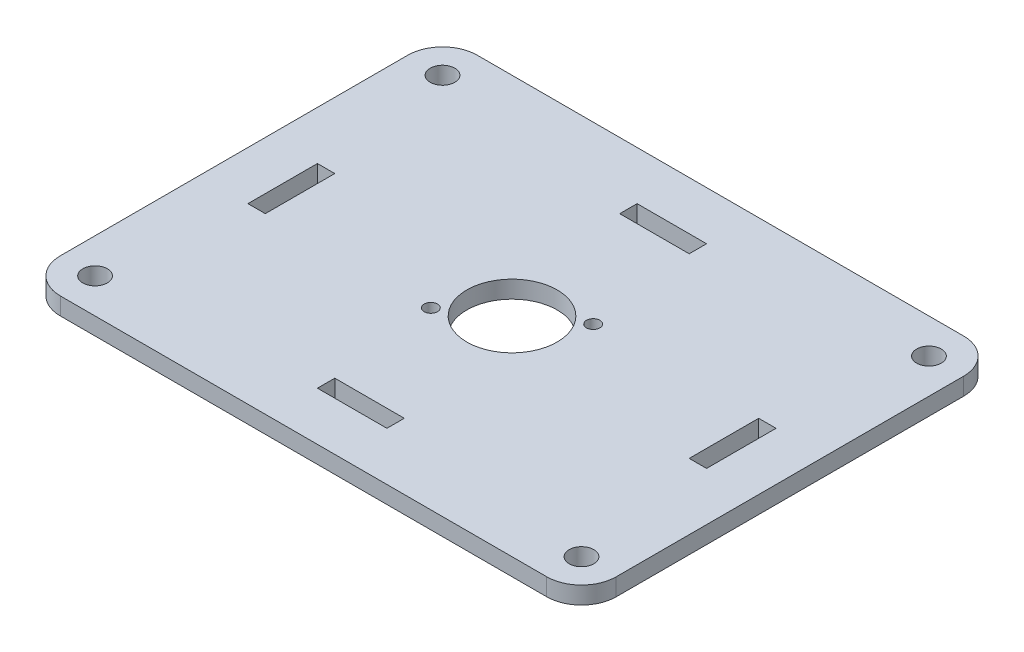
ISO-10303-21;
HEADER;
FILE_DESCRIPTION(('STEP AP214'),'2;1');
FILE_NAME('part.step','',(''),(''),'','','');
FILE_SCHEMA(('AUTOMOTIVE_DESIGN { 1 0 10303 214 1 1 1 1 }'));
ENDSEC;
DATA;
#1=APPLICATION_CONTEXT('core data for automotive mechanical design processes');
#2=APPLICATION_PROTOCOL_DEFINITION('international standard','automotive_design',2000,#1);
#3=PRODUCT_CONTEXT('',#1,'mechanical');
#4=PRODUCT('Part','Part','',(#3));
#5=PRODUCT_RELATED_PRODUCT_CATEGORY('part','',(#4));
#6=PRODUCT_DEFINITION_FORMATION('','',#4);
#7=PRODUCT_DEFINITION_CONTEXT('part definition',#1,'design');
#8=PRODUCT_DEFINITION('design','',#6,#7);
#9=PRODUCT_DEFINITION_SHAPE('','',#8);
#10=(LENGTH_UNIT() NAMED_UNIT(*) SI_UNIT(.MILLI.,.METRE.));
#11=(NAMED_UNIT(*) PLANE_ANGLE_UNIT() SI_UNIT($,.RADIAN.));
#12=(NAMED_UNIT(*) SI_UNIT($,.STERADIAN.) SOLID_ANGLE_UNIT());
#13=UNCERTAINTY_MEASURE_WITH_UNIT(LENGTH_MEASURE(1.E-05),#10,'distance_accuracy_value','');
#14=(GEOMETRIC_REPRESENTATION_CONTEXT(3) GLOBAL_UNCERTAINTY_ASSIGNED_CONTEXT((#13)) GLOBAL_UNIT_ASSIGNED_CONTEXT((#10,
#11,#12)) REPRESENTATION_CONTEXT('',''));
#15=CARTESIAN_POINT('',(0.,0.,0.));
#16=DIRECTION('',(0.,0.,1.));
#17=DIRECTION('',(1.,0.,0.));
#18=AXIS2_PLACEMENT_3D('',#15,#16,#17);
#19=CARTESIAN_POINT('',(50.8,3.175,38.1));
#20=DIRECTION('',(-1.,0.,0.));
#21=DIRECTION('',(0.,0.,1.));
#22=AXIS2_PLACEMENT_3D('',#19,#20,#21);
#23=PLANE('',#22);
#24=DIRECTION('',(0.,0.,-1.));
#25=VECTOR('',#24,1.);
#26=CARTESIAN_POINT('',(50.8,3.175,38.1));
#27=LINE('',#26,#25);
#28=CARTESIAN_POINT('',(50.8,3.175,31.75));
#29=VERTEX_POINT('',#28);
#30=CARTESIAN_POINT('',(50.8,3.175,-31.75));
#31=VERTEX_POINT('',#30);
#32=EDGE_CURVE('E394',#29,#31,#27,.T.);
#33=ORIENTED_EDGE('',*,*,#32,.F.);
#34=DIRECTION('',(0.,-1.,0.));
#35=VECTOR('',#34,1.);
#36=CARTESIAN_POINT('',(50.8,3.175,31.75));
#37=LINE('',#36,#35);
#38=CARTESIAN_POINT('',(50.8,0.,31.75));
#39=VERTEX_POINT('',#38);
#40=EDGE_CURVE('E428',#29,#39,#37,.T.);
#41=ORIENTED_EDGE('',*,*,#40,.T.);
#42=DIRECTION('',(0.,0.,-1.));
#43=VECTOR('',#42,1.);
#44=CARTESIAN_POINT('',(50.8,0.,38.1));
#45=LINE('',#44,#43);
#46=CARTESIAN_POINT('',(50.8,0.,-31.75));
#47=VERTEX_POINT('',#46);
#48=EDGE_CURVE('E385',#39,#47,#45,.T.);
#49=ORIENTED_EDGE('',*,*,#48,.T.);
#50=DIRECTION('',(0.,-1.,0.));
#51=VECTOR('',#50,1.);
#52=CARTESIAN_POINT('',(50.8,3.175,-31.75));
#53=LINE('',#52,#51);
#54=EDGE_CURVE('E411',#47,#31,#53,.F.);
#55=ORIENTED_EDGE('',*,*,#54,.T.);
#56=EDGE_LOOP('',(#33,#41,#49,#55));
#57=FACE_BOUND('',#56,.T.);
#58=ADVANCED_FACE('F38',(#57),#23,.F.);
#59=CARTESIAN_POINT('',(-50.8,3.175,-38.1));
#60=DIRECTION('',(0.,0.,1.));
#61=DIRECTION('',(1.,0.,0.));
#62=AXIS2_PLACEMENT_3D('',#59,#60,#61);
#63=PLANE('',#62);
#64=DIRECTION('',(-1.,0.,0.));
#65=VECTOR('',#64,1.);
#66=CARTESIAN_POINT('',(-50.8,3.175,-38.1));
#67=LINE('',#66,#65);
#68=CARTESIAN_POINT('',(44.45,3.175,-38.1));
#69=VERTEX_POINT('',#68);
#70=CARTESIAN_POINT('',(-44.45,3.175,-38.1));
#71=VERTEX_POINT('',#70);
#72=EDGE_CURVE('E398',#69,#71,#67,.T.);
#73=ORIENTED_EDGE('',*,*,#72,.F.);
#74=DIRECTION('',(0.,-1.,0.));
#75=VECTOR('',#74,1.);
#76=CARTESIAN_POINT('',(44.45,3.175,-38.1));
#77=LINE('',#76,#75);
#78=CARTESIAN_POINT('',(44.45,0.,-38.1));
#79=VERTEX_POINT('',#78);
#80=EDGE_CURVE('E466',#69,#79,#77,.T.);
#81=ORIENTED_EDGE('',*,*,#80,.T.);
#82=DIRECTION('',(-1.,0.,0.));
#83=VECTOR('',#82,1.);
#84=CARTESIAN_POINT('',(-50.8,0.,-38.1));
#85=LINE('',#84,#83);
#86=CARTESIAN_POINT('',(-44.45,0.,-38.1));
#87=VERTEX_POINT('',#86);
#88=EDGE_CURVE('E415',#79,#87,#85,.T.);
#89=ORIENTED_EDGE('',*,*,#88,.T.);
#90=DIRECTION('',(0.,-1.,0.));
#91=VECTOR('',#90,1.);
#92=CARTESIAN_POINT('',(-44.45,3.175,-38.1));
#93=LINE('',#92,#91);
#94=EDGE_CURVE('E463',#87,#71,#93,.F.);
#95=ORIENTED_EDGE('',*,*,#94,.T.);
#96=EDGE_LOOP('',(#73,#81,#89,#95));
#97=FACE_BOUND('',#96,.T.);
#98=ADVANCED_FACE('F503',(#97),#63,.F.);
#99=CARTESIAN_POINT('',(-50.8,3.175,38.1));
#100=DIRECTION('',(1.,0.,0.));
#101=DIRECTION('',(0.,0.,-1.));
#102=AXIS2_PLACEMENT_3D('',#99,#100,#101);
#103=PLANE('',#102);
#104=DIRECTION('',(0.,0.,1.));
#105=VECTOR('',#104,1.);
#106=CARTESIAN_POINT('',(-50.8,3.175,38.1));
#107=LINE('',#106,#105);
#108=CARTESIAN_POINT('',(-50.8,3.175,-31.75));
#109=VERTEX_POINT('',#108);
#110=CARTESIAN_POINT('',(-50.8,3.175,31.75));
#111=VERTEX_POINT('',#110);
#112=EDGE_CURVE('E403',#109,#111,#107,.T.);
#113=ORIENTED_EDGE('',*,*,#112,.F.);
#114=DIRECTION('',(0.,-1.,0.));
#115=VECTOR('',#114,1.);
#116=CARTESIAN_POINT('',(-50.8,3.175,-31.75));
#117=LINE('',#116,#115);
#118=CARTESIAN_POINT('',(-50.8,0.,-31.75));
#119=VERTEX_POINT('',#118);
#120=EDGE_CURVE('E11',#109,#119,#117,.T.);
#121=ORIENTED_EDGE('',*,*,#120,.T.);
#122=DIRECTION('',(0.,0.,1.));
#123=VECTOR('',#122,1.);
#124=CARTESIAN_POINT('',(-50.8,0.,38.1));
#125=LINE('',#124,#123);
#126=CARTESIAN_POINT('',(-50.8,0.,31.75));
#127=VERTEX_POINT('',#126);
#128=EDGE_CURVE('E419',#119,#127,#125,.T.);
#129=ORIENTED_EDGE('',*,*,#128,.T.);
#130=DIRECTION('',(0.,-1.,0.));
#131=VECTOR('',#130,1.);
#132=CARTESIAN_POINT('',(-50.8,3.175,31.75));
#133=LINE('',#132,#131);
#134=EDGE_CURVE('E47',#127,#111,#133,.F.);
#135=ORIENTED_EDGE('',*,*,#134,.T.);
#136=EDGE_LOOP('',(#113,#121,#129,#135));
#137=FACE_BOUND('',#136,.T.);
#138=ADVANCED_FACE('F473',(#137),#103,.F.);
#139=CARTESIAN_POINT('',(-50.8,3.175,38.1));
#140=DIRECTION('',(0.,0.,-1.));
#141=DIRECTION('',(-1.,0.,0.));
#142=AXIS2_PLACEMENT_3D('',#139,#140,#141);
#143=PLANE('',#142);
#144=DIRECTION('',(1.,0.,0.));
#145=VECTOR('',#144,1.);
#146=CARTESIAN_POINT('',(-50.8,0.,38.1));
#147=LINE('',#146,#145);
#148=CARTESIAN_POINT('',(-44.45,0.,38.1));
#149=VERTEX_POINT('',#148);
#150=CARTESIAN_POINT('',(44.45,0.,38.1));
#151=VERTEX_POINT('',#150);
#152=EDGE_CURVE('E399',#149,#151,#147,.T.);
#153=ORIENTED_EDGE('',*,*,#152,.T.);
#154=DIRECTION('',(0.,-1.,0.));
#155=VECTOR('',#154,1.);
#156=CARTESIAN_POINT('',(44.45,3.175,38.1));
#157=LINE('',#156,#155);
#158=CARTESIAN_POINT('',(44.45,3.175,38.1));
#159=VERTEX_POINT('',#158);
#160=EDGE_CURVE('E448',#151,#159,#157,.F.);
#161=ORIENTED_EDGE('',*,*,#160,.T.);
#162=DIRECTION('',(1.,0.,0.));
#163=VECTOR('',#162,1.);
#164=CARTESIAN_POINT('',(-50.8,3.175,38.1));
#165=LINE('',#164,#163);
#166=CARTESIAN_POINT('',(-44.45,3.175,38.1));
#167=VERTEX_POINT('',#166);
#168=EDGE_CURVE('E407',#167,#159,#165,.T.);
#169=ORIENTED_EDGE('',*,*,#168,.F.);
#170=DIRECTION('',(0.,-1.,0.));
#171=VECTOR('',#170,1.);
#172=CARTESIAN_POINT('',(-44.45,3.175,38.1));
#173=LINE('',#172,#171);
#174=EDGE_CURVE('E444',#167,#149,#173,.T.);
#175=ORIENTED_EDGE('',*,*,#174,.T.);
#176=EDGE_LOOP('',(#153,#161,#169,#175));
#177=FACE_BOUND('',#176,.T.);
#178=ADVANCED_FACE('F485',(#177),#143,.F.);
#179=CARTESIAN_POINT('',(0.,3.175,0.));
#180=DIRECTION('',(0.,-1.,0.));
#181=DIRECTION('',(0.,0.,-1.));
#182=AXIS2_PLACEMENT_3D('',#179,#180,#181);
#183=PLANE('',#182);
#184=CARTESIAN_POINT('',(8.6995,3.175,-6.1341));
#185=DIRECTION('',(0.,1.,0.));
#186=DIRECTION('',(0.,0.,1.));
#187=AXIS2_PLACEMENT_3D('',#184,#185,#186);
#188=CIRCLE('',#187,1.2192);
#189=CARTESIAN_POINT('',(8.6995,3.175,-4.9149));
#190=VERTEX_POINT('',#189);
#191=EDGE_CURVE('E817',#190,#190,#188,.T.);
#192=ORIENTED_EDGE('',*,*,#191,.F.);
#193=EDGE_LOOP('',(#192));
#194=FACE_BOUND('',#193,.T.);
#195=CARTESIAN_POINT('',(-8.6995,3.175,6.1341));
#196=DIRECTION('',(0.,1.,0.));
#197=DIRECTION('',(0.,0.,1.));
#198=AXIS2_PLACEMENT_3D('',#195,#196,#197);
#199=CIRCLE('',#198,1.2192);
#200=CARTESIAN_POINT('',(-8.6995,3.175,7.3533));
#201=VERTEX_POINT('',#200);
#202=EDGE_CURVE('E821',#201,#201,#199,.T.);
#203=ORIENTED_EDGE('',*,*,#202,.F.);
#204=EDGE_LOOP('',(#203));
#205=FACE_BOUND('',#204,.T.);
#206=CARTESIAN_POINT('',(0.,3.175,0.));
#207=DIRECTION('',(0.,1.,0.));
#208=DIRECTION('',(0.,0.,1.));
#209=AXIS2_PLACEMENT_3D('',#206,#207,#208);
#210=CIRCLE('',#209,8.255);
#211=CARTESIAN_POINT('',(0.,3.175,8.255));
#212=VERTEX_POINT('',#211);
#213=EDGE_CURVE('E830',#212,#212,#210,.T.);
#214=ORIENTED_EDGE('',*,*,#213,.F.);
#215=EDGE_LOOP('',(#214));
#216=FACE_BOUND('',#215,.T.);
#217=CARTESIAN_POINT('',(-44.45,3.175,-31.75));
#218=DIRECTION('',(0.,1.,0.));
#219=DIRECTION('',(0.,0.,1.));
#220=AXIS2_PLACEMENT_3D('',#217,#218,#219);
#221=CIRCLE('',#220,2.2479);
#222=CARTESIAN_POINT('',(-44.45,3.175,-29.5021));
#223=VERTEX_POINT('',#222);
#224=EDGE_CURVE('E259',#223,#223,#221,.T.);
#225=ORIENTED_EDGE('',*,*,#224,.F.);
#226=EDGE_LOOP('',(#225));
#227=FACE_BOUND('',#226,.T.);
#228=DIRECTION('',(1.,0.,0.));
#229=VECTOR('',#228,1.);
#230=CARTESIAN_POINT('',(0.,3.175,29.21));
#231=LINE('',#230,#229);
#232=CARTESIAN_POINT('',(-6.35,3.175,29.21));
#233=VERTEX_POINT('',#232);
#234=CARTESIAN_POINT('',(6.35,3.175,29.21));
#235=VERTEX_POINT('',#234);
#236=EDGE_CURVE('E236',#233,#235,#231,.T.);
#237=ORIENTED_EDGE('',*,*,#236,.F.);
#238=DIRECTION('',(0.,0.,1.));
#239=VECTOR('',#238,1.);
#240=CARTESIAN_POINT('',(-6.35,3.175,26.035));
#241=LINE('',#240,#239);
#242=CARTESIAN_POINT('',(-6.35,3.175,26.035));
#243=VERTEX_POINT('',#242);
#244=EDGE_CURVE('E54',#243,#233,#241,.T.);
#245=ORIENTED_EDGE('',*,*,#244,.F.);
#246=DIRECTION('',(-1.,0.,0.));
#247=VECTOR('',#246,1.);
#248=CARTESIAN_POINT('',(6.35,3.175,26.035));
#249=LINE('',#248,#247);
#250=CARTESIAN_POINT('',(6.35,3.175,26.035));
#251=VERTEX_POINT('',#250);
#252=EDGE_CURVE('E243',#251,#243,#249,.T.);
#253=ORIENTED_EDGE('',*,*,#252,.F.);
#254=DIRECTION('',(0.,0.,-1.));
#255=VECTOR('',#254,1.);
#256=CARTESIAN_POINT('',(6.35,3.175,29.21));
#257=LINE('',#256,#255);
#258=EDGE_CURVE('E206',#235,#251,#257,.T.);
#259=ORIENTED_EDGE('',*,*,#258,.F.);
#260=EDGE_LOOP('',(#237,#245,#253,#259));
#261=FACE_BOUND('',#260,.T.);
#262=DIRECTION('',(0.,0.,-1.));
#263=VECTOR('',#262,1.);
#264=CARTESIAN_POINT('',(41.91,3.175,0.));
#265=LINE('',#264,#263);
#266=CARTESIAN_POINT('',(41.91,3.175,6.35));
#267=VERTEX_POINT('',#266);
#268=CARTESIAN_POINT('',(41.91,3.175,-6.35));
#269=VERTEX_POINT('',#268);
#270=EDGE_CURVE('E251',#267,#269,#265,.T.);
#271=ORIENTED_EDGE('',*,*,#270,.F.);
#272=DIRECTION('',(1.,0.,0.));
#273=VECTOR('',#272,1.);
#274=CARTESIAN_POINT('',(38.735,3.175,6.35));
#275=LINE('',#274,#273);
#276=CARTESIAN_POINT('',(38.735,3.175,6.35));
#277=VERTEX_POINT('',#276);
#278=EDGE_CURVE('E62',#277,#267,#275,.T.);
#279=ORIENTED_EDGE('',*,*,#278,.F.);
#280=DIRECTION('',(0.,0.,1.));
#281=VECTOR('',#280,1.);
#282=CARTESIAN_POINT('',(38.735,3.175,-6.35));
#283=LINE('',#282,#281);
#284=CARTESIAN_POINT('',(38.735,3.175,-6.35));
#285=VERTEX_POINT('',#284);
#286=EDGE_CURVE('E334',#285,#277,#283,.T.);
#287=ORIENTED_EDGE('',*,*,#286,.F.);
#288=DIRECTION('',(-1.,0.,0.));
#289=VECTOR('',#288,1.);
#290=CARTESIAN_POINT('',(41.91,3.175,-6.35));
#291=LINE('',#290,#289);
#292=EDGE_CURVE('E330',#269,#285,#291,.T.);
#293=ORIENTED_EDGE('',*,*,#292,.F.);
#294=EDGE_LOOP('',(#271,#279,#287,#293));
#295=FACE_BOUND('',#294,.T.);
#296=DIRECTION('',(0.,0.,1.));
#297=VECTOR('',#296,1.);
#298=CARTESIAN_POINT('',(-6.35000000000001,3.175,-26.035));
#299=LINE('',#298,#297);
#300=CARTESIAN_POINT('',(-6.35000000000001,3.175,-29.21));
#301=VERTEX_POINT('',#300);
#302=CARTESIAN_POINT('',(-6.35000000000001,3.175,-26.035));
#303=VERTEX_POINT('',#302);
#304=EDGE_CURVE('E282',#301,#303,#299,.T.);
#305=ORIENTED_EDGE('',*,*,#304,.F.);
#306=DIRECTION('',(-1.,0.,0.));
#307=VECTOR('',#306,1.);
#308=CARTESIAN_POINT('',(0.,3.175,-29.21));
#309=LINE('',#308,#307);
#310=CARTESIAN_POINT('',(6.34999999999999,3.175,-29.21));
#311=VERTEX_POINT('',#310);
#312=EDGE_CURVE('E269',#311,#301,#309,.T.);
#313=ORIENTED_EDGE('',*,*,#312,.F.);
#314=DIRECTION('',(0.,0.,-1.));
#315=VECTOR('',#314,1.);
#316=CARTESIAN_POINT('',(6.34999999999999,3.175,-29.21));
#317=LINE('',#316,#315);
#318=CARTESIAN_POINT('',(6.34999999999999,3.175,-26.035));
#319=VERTEX_POINT('',#318);
#320=EDGE_CURVE('E291',#319,#311,#317,.T.);
#321=ORIENTED_EDGE('',*,*,#320,.F.);
#322=DIRECTION('',(1.,0.,0.));
#323=VECTOR('',#322,1.);
#324=CARTESIAN_POINT('',(6.34999999999999,3.175,-26.035));
#325=LINE('',#324,#323);
#326=EDGE_CURVE('E286',#303,#319,#325,.T.);
#327=ORIENTED_EDGE('',*,*,#326,.F.);
#328=EDGE_LOOP('',(#305,#313,#321,#327));
#329=FACE_BOUND('',#328,.T.);
#330=CARTESIAN_POINT('',(44.45,3.175,-31.75));
#331=DIRECTION('',(0.,1.,0.));
#332=DIRECTION('',(0.,0.,1.));
#333=AXIS2_PLACEMENT_3D('',#330,#331,#332);
#334=CIRCLE('',#333,2.2479);
#335=CARTESIAN_POINT('',(44.45,3.175,-29.5021));
#336=VERTEX_POINT('',#335);
#337=EDGE_CURVE('E838',#336,#336,#334,.T.);
#338=ORIENTED_EDGE('',*,*,#337,.F.);
#339=EDGE_LOOP('',(#338));
#340=FACE_BOUND('',#339,.T.);
#341=CARTESIAN_POINT('',(44.45,3.175,31.75));
#342=DIRECTION('',(0.,1.,0.));
#343=DIRECTION('',(0.,0.,1.));
#344=AXIS2_PLACEMENT_3D('',#341,#342,#343);
#345=CIRCLE('',#344,2.2479);
#346=CARTESIAN_POINT('',(44.45,3.175,33.9979));
#347=VERTEX_POINT('',#346);
#348=EDGE_CURVE('E846',#347,#347,#345,.T.);
#349=ORIENTED_EDGE('',*,*,#348,.F.);
#350=EDGE_LOOP('',(#349));
#351=FACE_BOUND('',#350,.T.);
#352=CARTESIAN_POINT('',(-44.45,3.175,31.75));
#353=DIRECTION('',(0.,1.,0.));
#354=DIRECTION('',(0.,0.,1.));
#355=AXIS2_PLACEMENT_3D('',#352,#353,#354);
#356=CIRCLE('',#355,2.2479);
#357=CARTESIAN_POINT('',(-44.45,3.175,33.9979));
#358=VERTEX_POINT('',#357);
#359=EDGE_CURVE('E829',#358,#358,#356,.T.);
#360=ORIENTED_EDGE('',*,*,#359,.F.);
#361=EDGE_LOOP('',(#360));
#362=FACE_BOUND('',#361,.T.);
#363=DIRECTION('',(1.,0.,0.));
#364=VECTOR('',#363,1.);
#365=CARTESIAN_POINT('',(-38.735,3.175,6.35000000000002));
#366=LINE('',#365,#364);
#367=CARTESIAN_POINT('',(-41.91,3.175,6.35000000000001));
#368=VERTEX_POINT('',#367);
#369=CARTESIAN_POINT('',(-38.735,3.175,6.35000000000002));
#370=VERTEX_POINT('',#369);
#371=EDGE_CURVE('E301',#368,#370,#366,.T.);
#372=ORIENTED_EDGE('',*,*,#371,.F.);
#373=DIRECTION('',(0.,0.,1.));
#374=VECTOR('',#373,1.);
#375=CARTESIAN_POINT('',(-41.91,3.175,0.));
#376=LINE('',#375,#374);
#377=CARTESIAN_POINT('',(-41.91,3.175,-6.34999999999999));
#378=VERTEX_POINT('',#377);
#379=EDGE_CURVE('E355',#378,#368,#376,.T.);
#380=ORIENTED_EDGE('',*,*,#379,.F.);
#381=DIRECTION('',(-1.,0.,0.));
#382=VECTOR('',#381,1.);
#383=CARTESIAN_POINT('',(-41.91,3.175,-6.34999999999999));
#384=LINE('',#383,#382);
#385=CARTESIAN_POINT('',(-38.735,3.175,-6.34999999999999));
#386=VERTEX_POINT('',#385);
#387=EDGE_CURVE('E375',#386,#378,#384,.T.);
#388=ORIENTED_EDGE('',*,*,#387,.F.);
#389=DIRECTION('',(0.,0.,-1.));
#390=VECTOR('',#389,1.);
#391=CARTESIAN_POINT('',(-38.735,3.175,-6.34999999999999));
#392=LINE('',#391,#390);
#393=EDGE_CURVE('E371',#370,#386,#392,.T.);
#394=ORIENTED_EDGE('',*,*,#393,.F.);
#395=EDGE_LOOP('',(#372,#380,#388,#394));
#396=FACE_BOUND('',#395,.T.);
#397=ORIENTED_EDGE('',*,*,#168,.T.);
#398=CARTESIAN_POINT('',(44.45,3.175,31.75));
#399=DIRECTION('',(0.,-1.,0.));
#400=DIRECTION('',(0.,0.,-1.));
#401=AXIS2_PLACEMENT_3D('',#398,#399,#400);
#402=CIRCLE('',#401,6.35);
#403=EDGE_CURVE('E460',#159,#29,#402,.F.);
#404=ORIENTED_EDGE('',*,*,#403,.T.);
#405=ORIENTED_EDGE('',*,*,#32,.T.);
#406=CARTESIAN_POINT('',(44.45,3.175,-31.75));
#407=DIRECTION('',(0.,-1.,0.));
#408=DIRECTION('',(0.,0.,-1.));
#409=AXIS2_PLACEMENT_3D('',#406,#407,#408);
#410=CIRCLE('',#409,6.35);
#411=EDGE_CURVE('E457',#31,#69,#410,.F.);
#412=ORIENTED_EDGE('',*,*,#411,.T.);
#413=ORIENTED_EDGE('',*,*,#72,.T.);
#414=CARTESIAN_POINT('',(-44.45,3.175,-31.75));
#415=DIRECTION('',(0.,-1.,0.));
#416=DIRECTION('',(0.,0.,-1.));
#417=AXIS2_PLACEMENT_3D('',#414,#415,#416);
#418=CIRCLE('',#417,6.35);
#419=EDGE_CURVE('E454',#71,#109,#418,.F.);
#420=ORIENTED_EDGE('',*,*,#419,.T.);
#421=ORIENTED_EDGE('',*,*,#112,.T.);
#422=CARTESIAN_POINT('',(-44.45,3.175,31.75));
#423=DIRECTION('',(0.,-1.,0.));
#424=DIRECTION('',(0.,0.,-1.));
#425=AXIS2_PLACEMENT_3D('',#422,#423,#424);
#426=CIRCLE('',#425,6.35);
#427=EDGE_CURVE('E451',#111,#167,#426,.F.);
#428=ORIENTED_EDGE('',*,*,#427,.T.);
#429=EDGE_LOOP('',(#397,#404,#405,#412,#413,#420,#421,#428));
#430=FACE_BOUND('',#429,.T.);
#431=ADVANCED_FACE('F479',(#194,#205,#216,#227,#261,#295,#329,#340,#351,#362,#396,#430),#183,.F.);
#432=CARTESIAN_POINT('',(0.,0.,0.));
#433=DIRECTION('',(0.,-1.,0.));
#434=DIRECTION('',(0.,0.,-1.));
#435=AXIS2_PLACEMENT_3D('',#432,#433,#434);
#436=PLANE('',#435);
#437=CARTESIAN_POINT('',(8.6995,0.,-6.1341));
#438=DIRECTION('',(0.,1.,0.));
#439=DIRECTION('',(0.,0.,1.));
#440=AXIS2_PLACEMENT_3D('',#437,#438,#439);
#441=CIRCLE('',#440,1.2192);
#442=CARTESIAN_POINT('',(8.6995,0.,-4.9149));
#443=VERTEX_POINT('',#442);
#444=EDGE_CURVE('E814',#443,#443,#441,.T.);
#445=ORIENTED_EDGE('',*,*,#444,.T.);
#446=EDGE_LOOP('',(#445));
#447=FACE_BOUND('',#446,.T.);
#448=CARTESIAN_POINT('',(-8.6995,0.,6.1341));
#449=DIRECTION('',(0.,1.,0.));
#450=DIRECTION('',(0.,0.,1.));
#451=AXIS2_PLACEMENT_3D('',#448,#449,#450);
#452=CIRCLE('',#451,1.2192);
#453=CARTESIAN_POINT('',(-8.6995,0.,7.3533));
#454=VERTEX_POINT('',#453);
#455=EDGE_CURVE('E834',#454,#454,#452,.T.);
#456=ORIENTED_EDGE('',*,*,#455,.T.);
#457=EDGE_LOOP('',(#456));
#458=FACE_BOUND('',#457,.T.);
#459=CARTESIAN_POINT('',(0.,0.,0.));
#460=DIRECTION('',(0.,1.,0.));
#461=DIRECTION('',(0.,0.,1.));
#462=AXIS2_PLACEMENT_3D('',#459,#460,#461);
#463=CIRCLE('',#462,8.255);
#464=CARTESIAN_POINT('',(0.,0.,8.255));
#465=VERTEX_POINT('',#464);
#466=EDGE_CURVE('E825',#465,#465,#463,.T.);
#467=ORIENTED_EDGE('',*,*,#466,.T.);
#468=EDGE_LOOP('',(#467));
#469=FACE_BOUND('',#468,.T.);
#470=CARTESIAN_POINT('',(-44.45,0.,-31.75));
#471=DIRECTION('',(0.,1.,0.));
#472=DIRECTION('',(0.,0.,1.));
#473=AXIS2_PLACEMENT_3D('',#470,#471,#472);
#474=CIRCLE('',#473,2.2479);
#475=CARTESIAN_POINT('',(-44.45,0.,-29.5021));
#476=VERTEX_POINT('',#475);
#477=EDGE_CURVE('E240',#476,#476,#474,.T.);
#478=ORIENTED_EDGE('',*,*,#477,.T.);
#479=EDGE_LOOP('',(#478));
#480=FACE_BOUND('',#479,.T.);
#481=DIRECTION('',(0.,0.,1.));
#482=VECTOR('',#481,1.);
#483=CARTESIAN_POINT('',(-6.35,0.,26.035));
#484=LINE('',#483,#482);
#485=CARTESIAN_POINT('',(-6.35,0.,26.035));
#486=VERTEX_POINT('',#485);
#487=CARTESIAN_POINT('',(-6.35,0.,29.21));
#488=VERTEX_POINT('',#487);
#489=EDGE_CURVE('E221',#486,#488,#484,.T.);
#490=ORIENTED_EDGE('',*,*,#489,.T.);
#491=DIRECTION('',(1.,0.,0.));
#492=VECTOR('',#491,1.);
#493=CARTESIAN_POINT('',(-6.35,0.,29.21));
#494=LINE('',#493,#492);
#495=CARTESIAN_POINT('',(6.35,0.,29.21));
#496=VERTEX_POINT('',#495);
#497=EDGE_CURVE('E227',#488,#496,#494,.T.);
#498=ORIENTED_EDGE('',*,*,#497,.T.);
#499=DIRECTION('',(0.,0.,-1.));
#500=VECTOR('',#499,1.);
#501=CARTESIAN_POINT('',(6.35,0.,29.21));
#502=LINE('',#501,#500);
#503=CARTESIAN_POINT('',(6.35,0.,26.035));
#504=VERTEX_POINT('',#503);
#505=EDGE_CURVE('E203',#496,#504,#502,.T.);
#506=ORIENTED_EDGE('',*,*,#505,.T.);
#507=DIRECTION('',(-1.,0.,0.));
#508=VECTOR('',#507,1.);
#509=CARTESIAN_POINT('',(6.35,0.,26.035));
#510=LINE('',#509,#508);
#511=EDGE_CURVE('E215',#504,#486,#510,.T.);
#512=ORIENTED_EDGE('',*,*,#511,.T.);
#513=EDGE_LOOP('',(#490,#498,#506,#512));
#514=FACE_BOUND('',#513,.T.);
#515=DIRECTION('',(1.,0.,0.));
#516=VECTOR('',#515,1.);
#517=CARTESIAN_POINT('',(38.735,0.,6.35));
#518=LINE('',#517,#516);
#519=CARTESIAN_POINT('',(38.735,0.,6.35));
#520=VERTEX_POINT('',#519);
#521=CARTESIAN_POINT('',(41.91,0.,6.35));
#522=VERTEX_POINT('',#521);
#523=EDGE_CURVE('E322',#520,#522,#518,.T.);
#524=ORIENTED_EDGE('',*,*,#523,.T.);
#525=DIRECTION('',(0.,0.,-1.));
#526=VECTOR('',#525,1.);
#527=CARTESIAN_POINT('',(41.91,0.,6.35));
#528=LINE('',#527,#526);
#529=CARTESIAN_POINT('',(41.91,0.,-6.35));
#530=VERTEX_POINT('',#529);
#531=EDGE_CURVE('E310',#522,#530,#528,.T.);
#532=ORIENTED_EDGE('',*,*,#531,.T.);
#533=DIRECTION('',(-1.,0.,0.));
#534=VECTOR('',#533,1.);
#535=CARTESIAN_POINT('',(41.91,0.,-6.35));
#536=LINE('',#535,#534);
#537=CARTESIAN_POINT('',(38.735,0.,-6.35));
#538=VERTEX_POINT('',#537);
#539=EDGE_CURVE('E314',#530,#538,#536,.T.);
#540=ORIENTED_EDGE('',*,*,#539,.T.);
#541=DIRECTION('',(0.,0.,1.));
#542=VECTOR('',#541,1.);
#543=CARTESIAN_POINT('',(38.735,0.,-6.35));
#544=LINE('',#543,#542);
#545=EDGE_CURVE('E318',#538,#520,#544,.T.);
#546=ORIENTED_EDGE('',*,*,#545,.T.);
#547=EDGE_LOOP('',(#524,#532,#540,#546));
#548=FACE_BOUND('',#547,.T.);
#549=DIRECTION('',(-1.,0.,0.));
#550=VECTOR('',#549,1.);
#551=CARTESIAN_POINT('',(-6.35000000000001,0.,-29.21));
#552=LINE('',#551,#550);
#553=CARTESIAN_POINT('',(6.34999999999999,0.,-29.21));
#554=VERTEX_POINT('',#553);
#555=CARTESIAN_POINT('',(-6.35000000000001,0.,-29.21));
#556=VERTEX_POINT('',#555);
#557=EDGE_CURVE('E264',#554,#556,#552,.T.);
#558=ORIENTED_EDGE('',*,*,#557,.T.);
#559=DIRECTION('',(0.,0.,1.));
#560=VECTOR('',#559,1.);
#561=CARTESIAN_POINT('',(-6.35000000000001,0.,-26.035));
#562=LINE('',#561,#560);
#563=CARTESIAN_POINT('',(-6.35000000000001,0.,-26.035));
#564=VERTEX_POINT('',#563);
#565=EDGE_CURVE('E268',#556,#564,#562,.T.);
#566=ORIENTED_EDGE('',*,*,#565,.T.);
#567=DIRECTION('',(1.,0.,0.));
#568=VECTOR('',#567,1.);
#569=CARTESIAN_POINT('',(6.34999999999999,0.,-26.035));
#570=LINE('',#569,#568);
#571=CARTESIAN_POINT('',(6.34999999999999,0.,-26.035));
#572=VERTEX_POINT('',#571);
#573=EDGE_CURVE('E273',#564,#572,#570,.T.);
#574=ORIENTED_EDGE('',*,*,#573,.T.);
#575=DIRECTION('',(0.,0.,-1.));
#576=VECTOR('',#575,1.);
#577=CARTESIAN_POINT('',(6.34999999999999,0.,-29.21));
#578=LINE('',#577,#576);
#579=EDGE_CURVE('E277',#572,#554,#578,.T.);
#580=ORIENTED_EDGE('',*,*,#579,.T.);
#581=EDGE_LOOP('',(#558,#566,#574,#580));
#582=FACE_BOUND('',#581,.T.);
#583=CARTESIAN_POINT('',(44.45,0.,-31.75));
#584=DIRECTION('',(0.,1.,0.));
#585=DIRECTION('',(0.,0.,1.));
#586=AXIS2_PLACEMENT_3D('',#583,#584,#585);
#587=CIRCLE('',#586,2.2479);
#588=CARTESIAN_POINT('',(44.45,0.,-29.5021));
#589=VERTEX_POINT('',#588);
#590=EDGE_CURVE('E263',#589,#589,#587,.T.);
#591=ORIENTED_EDGE('',*,*,#590,.T.);
#592=EDGE_LOOP('',(#591));
#593=FACE_BOUND('',#592,.T.);
#594=CARTESIAN_POINT('',(44.45,0.,31.75));
#595=DIRECTION('',(0.,1.,0.));
#596=DIRECTION('',(0.,0.,1.));
#597=AXIS2_PLACEMENT_3D('',#594,#595,#596);
#598=CIRCLE('',#597,2.2479);
#599=CARTESIAN_POINT('',(44.45,0.,33.9979));
#600=VERTEX_POINT('',#599);
#601=EDGE_CURVE('E842',#600,#600,#598,.T.);
#602=ORIENTED_EDGE('',*,*,#601,.T.);
#603=EDGE_LOOP('',(#602));
#604=FACE_BOUND('',#603,.T.);
#605=CARTESIAN_POINT('',(-44.45,0.,31.75));
#606=DIRECTION('',(0.,1.,0.));
#607=DIRECTION('',(0.,0.,1.));
#608=AXIS2_PLACEMENT_3D('',#605,#606,#607);
#609=CIRCLE('',#608,2.2479);
#610=CARTESIAN_POINT('',(-44.45,0.,33.9979));
#611=VERTEX_POINT('',#610);
#612=EDGE_CURVE('E850',#611,#611,#609,.T.);
#613=ORIENTED_EDGE('',*,*,#612,.T.);
#614=EDGE_LOOP('',(#613));
#615=FACE_BOUND('',#614,.T.);
#616=DIRECTION('',(0.,0.,1.));
#617=VECTOR('',#616,1.);
#618=CARTESIAN_POINT('',(-41.91,0.,6.35000000000001));
#619=LINE('',#618,#617);
#620=CARTESIAN_POINT('',(-41.91,0.,-6.34999999999999));
#621=VERTEX_POINT('',#620);
#622=CARTESIAN_POINT('',(-41.91,0.,6.35000000000001));
#623=VERTEX_POINT('',#622);
#624=EDGE_CURVE('E350',#621,#623,#619,.T.);
#625=ORIENTED_EDGE('',*,*,#624,.T.);
#626=DIRECTION('',(1.,0.,0.));
#627=VECTOR('',#626,1.);
#628=CARTESIAN_POINT('',(-38.735,0.,6.35000000000002));
#629=LINE('',#628,#627);
#630=CARTESIAN_POINT('',(-38.735,0.,6.35000000000002));
#631=VERTEX_POINT('',#630);
#632=EDGE_CURVE('E354',#623,#631,#629,.T.);
#633=ORIENTED_EDGE('',*,*,#632,.T.);
#634=DIRECTION('',(0.,0.,-1.));
#635=VECTOR('',#634,1.);
#636=CARTESIAN_POINT('',(-38.735,0.,-6.34999999999999));
#637=LINE('',#636,#635);
#638=CARTESIAN_POINT('',(-38.735,0.,-6.34999999999999));
#639=VERTEX_POINT('',#638);
#640=EDGE_CURVE('E359',#631,#639,#637,.T.);
#641=ORIENTED_EDGE('',*,*,#640,.T.);
#642=DIRECTION('',(-1.,0.,0.));
#643=VECTOR('',#642,1.);
#644=CARTESIAN_POINT('',(-41.91,0.,-6.34999999999999));
#645=LINE('',#644,#643);
#646=EDGE_CURVE('E363',#639,#621,#645,.T.);
#647=ORIENTED_EDGE('',*,*,#646,.T.);
#648=EDGE_LOOP('',(#625,#633,#641,#647));
#649=FACE_BOUND('',#648,.T.);
#650=ORIENTED_EDGE('',*,*,#48,.F.);
#651=CARTESIAN_POINT('',(44.45,0.,31.75));
#652=DIRECTION('',(0.,-1.,0.));
#653=DIRECTION('',(0.,0.,-1.));
#654=AXIS2_PLACEMENT_3D('',#651,#652,#653);
#655=CIRCLE('',#654,6.35);
#656=EDGE_CURVE('E441',#39,#151,#655,.T.);
#657=ORIENTED_EDGE('',*,*,#656,.T.);
#658=ORIENTED_EDGE('',*,*,#152,.F.);
#659=CARTESIAN_POINT('',(-44.45,0.,31.75));
#660=DIRECTION('',(0.,-1.,0.));
#661=DIRECTION('',(0.,0.,-1.));
#662=AXIS2_PLACEMENT_3D('',#659,#660,#661);
#663=CIRCLE('',#662,6.35);
#664=EDGE_CURVE('E432',#149,#127,#663,.T.);
#665=ORIENTED_EDGE('',*,*,#664,.T.);
#666=ORIENTED_EDGE('',*,*,#128,.F.);
#667=CARTESIAN_POINT('',(-44.45,0.,-31.75));
#668=DIRECTION('',(0.,-1.,0.));
#669=DIRECTION('',(0.,0.,-1.));
#670=AXIS2_PLACEMENT_3D('',#667,#668,#669);
#671=CIRCLE('',#670,6.35);
#672=EDGE_CURVE('E435',#119,#87,#671,.T.);
#673=ORIENTED_EDGE('',*,*,#672,.T.);
#674=ORIENTED_EDGE('',*,*,#88,.F.);
#675=CARTESIAN_POINT('',(44.45,0.,-31.75));
#676=DIRECTION('',(0.,-1.,0.));
#677=DIRECTION('',(0.,0.,-1.));
#678=AXIS2_PLACEMENT_3D('',#675,#676,#677);
#679=CIRCLE('',#678,6.35);
#680=EDGE_CURVE('E438',#79,#47,#679,.T.);
#681=ORIENTED_EDGE('',*,*,#680,.T.);
#682=EDGE_LOOP('',(#650,#657,#658,#665,#666,#673,#674,#681));
#683=FACE_BOUND('',#682,.T.);
#684=ADVANCED_FACE('F224',(#447,#458,#469,#480,#514,#548,#582,#593,#604,#615,#649,#683),#436,.T.);
#685=CARTESIAN_POINT('',(44.45,3.175,31.75));
#686=DIRECTION('',(0.,-1.,0.));
#687=DIRECTION('',(0.,0.,-1.));
#688=AXIS2_PLACEMENT_3D('',#685,#686,#687);
#689=CYLINDRICAL_SURFACE('',#688,6.35);
#690=ORIENTED_EDGE('',*,*,#403,.F.);
#691=ORIENTED_EDGE('',*,*,#160,.F.);
#692=ORIENTED_EDGE('',*,*,#656,.F.);
#693=ORIENTED_EDGE('',*,*,#40,.F.);
#694=EDGE_LOOP('',(#690,#691,#692,#693));
#695=FACE_BOUND('',#694,.T.);
#696=ADVANCED_FACE('F492',(#695),#689,.T.);
#697=CARTESIAN_POINT('',(44.45,3.175,-31.75));
#698=DIRECTION('',(0.,-1.,0.));
#699=DIRECTION('',(0.,0.,-1.));
#700=AXIS2_PLACEMENT_3D('',#697,#698,#699);
#701=CYLINDRICAL_SURFACE('',#700,6.35);
#702=ORIENTED_EDGE('',*,*,#411,.F.);
#703=ORIENTED_EDGE('',*,*,#54,.F.);
#704=ORIENTED_EDGE('',*,*,#680,.F.);
#705=ORIENTED_EDGE('',*,*,#80,.F.);
#706=EDGE_LOOP('',(#702,#703,#704,#705));
#707=FACE_BOUND('',#706,.T.);
#708=ADVANCED_FACE('F500',(#707),#701,.T.);
#709=CARTESIAN_POINT('',(-44.45,3.175,-31.75));
#710=DIRECTION('',(0.,-1.,0.));
#711=DIRECTION('',(0.,0.,-1.));
#712=AXIS2_PLACEMENT_3D('',#709,#710,#711);
#713=CYLINDRICAL_SURFACE('',#712,6.35);
#714=ORIENTED_EDGE('',*,*,#419,.F.);
#715=ORIENTED_EDGE('',*,*,#94,.F.);
#716=ORIENTED_EDGE('',*,*,#672,.F.);
#717=ORIENTED_EDGE('',*,*,#120,.F.);
#718=EDGE_LOOP('',(#714,#715,#716,#717));
#719=FACE_BOUND('',#718,.T.);
#720=ADVANCED_FACE('F506',(#719),#713,.T.);
#721=CARTESIAN_POINT('',(-44.45,3.175,31.75));
#722=DIRECTION('',(0.,-1.,0.));
#723=DIRECTION('',(0.,0.,-1.));
#724=AXIS2_PLACEMENT_3D('',#721,#722,#723);
#725=CYLINDRICAL_SURFACE('',#724,6.35);
#726=ORIENTED_EDGE('',*,*,#427,.F.);
#727=ORIENTED_EDGE('',*,*,#134,.F.);
#728=ORIENTED_EDGE('',*,*,#664,.F.);
#729=ORIENTED_EDGE('',*,*,#174,.F.);
#730=EDGE_LOOP('',(#726,#727,#728,#729));
#731=FACE_BOUND('',#730,.T.);
#732=ADVANCED_FACE('F40',(#731),#725,.T.);
#733=CARTESIAN_POINT('',(-41.91,0.,0.));
#734=DIRECTION('',(-1.,0.,0.));
#735=DIRECTION('',(0.,0.,1.));
#736=AXIS2_PLACEMENT_3D('',#733,#734,#735);
#737=PLANE('',#736);
#738=ORIENTED_EDGE('',*,*,#379,.T.);
#739=DIRECTION('',(0.,1.,0.));
#740=VECTOR('',#739,1.);
#741=CARTESIAN_POINT('',(-41.91,0.,6.35000000000001));
#742=LINE('',#741,#740);
#743=EDGE_CURVE('E367',#623,#368,#742,.T.);
#744=ORIENTED_EDGE('',*,*,#743,.F.);
#745=ORIENTED_EDGE('',*,*,#624,.F.);
#746=DIRECTION('',(0.,1.,0.));
#747=VECTOR('',#746,1.);
#748=CARTESIAN_POINT('',(-41.91,0.,-6.34999999999999));
#749=LINE('',#748,#747);
#750=EDGE_CURVE('E382',#621,#378,#749,.T.);
#751=ORIENTED_EDGE('',*,*,#750,.T.);
#752=EDGE_LOOP('',(#738,#744,#745,#751));
#753=FACE_BOUND('',#752,.T.);
#754=ADVANCED_FACE('F512',(#753),#737,.F.);
#755=CARTESIAN_POINT('',(-41.91,0.,-6.34999999999999));
#756=DIRECTION('',(0.,0.,-1.));
#757=DIRECTION('',(-1.,0.,0.));
#758=AXIS2_PLACEMENT_3D('',#755,#756,#757);
#759=PLANE('',#758);
#760=ORIENTED_EDGE('',*,*,#387,.T.);
#761=ORIENTED_EDGE('',*,*,#750,.F.);
#762=ORIENTED_EDGE('',*,*,#646,.F.);
#763=DIRECTION('',(0.,1.,0.));
#764=VECTOR('',#763,1.);
#765=CARTESIAN_POINT('',(-38.735,0.,-6.34999999999999));
#766=LINE('',#765,#764);
#767=EDGE_CURVE('E386',#639,#386,#766,.T.);
#768=ORIENTED_EDGE('',*,*,#767,.T.);
#769=EDGE_LOOP('',(#760,#761,#762,#768));
#770=FACE_BOUND('',#769,.T.);
#771=ADVANCED_FACE('F585',(#770),#759,.F.);
#772=CARTESIAN_POINT('',(-38.735,0.,-6.34999999999999));
#773=DIRECTION('',(1.,0.,0.));
#774=DIRECTION('',(0.,0.,-1.));
#775=AXIS2_PLACEMENT_3D('',#772,#773,#774);
#776=PLANE('',#775);
#777=ORIENTED_EDGE('',*,*,#393,.T.);
#778=ORIENTED_EDGE('',*,*,#767,.F.);
#779=ORIENTED_EDGE('',*,*,#640,.F.);
#780=DIRECTION('',(0.,1.,0.));
#781=VECTOR('',#780,1.);
#782=CARTESIAN_POINT('',(-38.735,0.,6.35000000000002));
#783=LINE('',#782,#781);
#784=EDGE_CURVE('E389',#631,#370,#783,.T.);
#785=ORIENTED_EDGE('',*,*,#784,.T.);
#786=EDGE_LOOP('',(#777,#778,#779,#785));
#787=FACE_BOUND('',#786,.T.);
#788=ADVANCED_FACE('F597',(#787),#776,.F.);
#789=CARTESIAN_POINT('',(-38.735,0.,6.35000000000002));
#790=DIRECTION('',(0.,0.,1.));
#791=DIRECTION('',(1.,0.,0.));
#792=AXIS2_PLACEMENT_3D('',#789,#790,#791);
#793=PLANE('',#792);
#794=ORIENTED_EDGE('',*,*,#371,.T.);
#795=ORIENTED_EDGE('',*,*,#784,.F.);
#796=ORIENTED_EDGE('',*,*,#632,.F.);
#797=ORIENTED_EDGE('',*,*,#743,.T.);
#798=EDGE_LOOP('',(#794,#795,#796,#797));
#799=FACE_BOUND('',#798,.T.);
#800=ADVANCED_FACE('F606',(#799),#793,.F.);
#801=CARTESIAN_POINT('',(-44.45,0.,31.75));
#802=DIRECTION('',(0.,1.,0.));
#803=DIRECTION('',(0.,0.,1.));
#804=AXIS2_PLACEMENT_3D('',#801,#802,#803);
#805=CYLINDRICAL_SURFACE('',#804,2.2479);
#806=ORIENTED_EDGE('',*,*,#612,.F.);
#807=EDGE_LOOP('',(#806));
#808=FACE_BOUND('',#807,.T.);
#809=ORIENTED_EDGE('',*,*,#359,.T.);
#810=EDGE_LOOP('',(#809));
#811=FACE_BOUND('',#810,.T.);
#812=ADVANCED_FACE('F615',(#808,#811),#805,.F.);
#813=CARTESIAN_POINT('',(44.45,0.,31.75));
#814=DIRECTION('',(0.,1.,0.));
#815=DIRECTION('',(0.,0.,1.));
#816=AXIS2_PLACEMENT_3D('',#813,#814,#815);
#817=CYLINDRICAL_SURFACE('',#816,2.2479);
#818=ORIENTED_EDGE('',*,*,#601,.F.);
#819=EDGE_LOOP('',(#818));
#820=FACE_BOUND('',#819,.T.);
#821=ORIENTED_EDGE('',*,*,#348,.T.);
#822=EDGE_LOOP('',(#821));
#823=FACE_BOUND('',#822,.T.);
#824=ADVANCED_FACE('F623',(#820,#823),#817,.F.);
#825=CARTESIAN_POINT('',(44.45,0.,-31.75));
#826=DIRECTION('',(0.,1.,0.));
#827=DIRECTION('',(0.,0.,1.));
#828=AXIS2_PLACEMENT_3D('',#825,#826,#827);
#829=CYLINDRICAL_SURFACE('',#828,2.2479);
#830=ORIENTED_EDGE('',*,*,#590,.F.);
#831=EDGE_LOOP('',(#830));
#832=FACE_BOUND('',#831,.T.);
#833=ORIENTED_EDGE('',*,*,#337,.T.);
#834=EDGE_LOOP('',(#833));
#835=FACE_BOUND('',#834,.T.);
#836=ADVANCED_FACE('F632',(#832,#835),#829,.F.);
#837=CARTESIAN_POINT('',(0.,0.,-29.21));
#838=DIRECTION('',(0.,0.,-1.));
#839=DIRECTION('',(-1.,0.,0.));
#840=AXIS2_PLACEMENT_3D('',#837,#838,#839);
#841=PLANE('',#840);
#842=ORIENTED_EDGE('',*,*,#312,.T.);
#843=DIRECTION('',(0.,1.,0.));
#844=VECTOR('',#843,1.);
#845=CARTESIAN_POINT('',(-6.35000000000001,0.,-29.21));
#846=LINE('',#845,#844);
#847=EDGE_CURVE('E281',#556,#301,#846,.T.);
#848=ORIENTED_EDGE('',*,*,#847,.F.);
#849=ORIENTED_EDGE('',*,*,#557,.F.);
#850=DIRECTION('',(0.,1.,0.));
#851=VECTOR('',#850,1.);
#852=CARTESIAN_POINT('',(6.34999999999999,0.,-29.21));
#853=LINE('',#852,#851);
#854=EDGE_CURVE('E298',#554,#311,#853,.T.);
#855=ORIENTED_EDGE('',*,*,#854,.T.);
#856=EDGE_LOOP('',(#842,#848,#849,#855));
#857=FACE_BOUND('',#856,.T.);
#858=ADVANCED_FACE('F641',(#857),#841,.F.);
#859=CARTESIAN_POINT('',(6.34999999999999,0.,-29.21));
#860=DIRECTION('',(1.,0.,0.));
#861=DIRECTION('',(0.,0.,-1.));
#862=AXIS2_PLACEMENT_3D('',#859,#860,#861);
#863=PLANE('',#862);
#864=ORIENTED_EDGE('',*,*,#320,.T.);
#865=ORIENTED_EDGE('',*,*,#854,.F.);
#866=ORIENTED_EDGE('',*,*,#579,.F.);
#867=DIRECTION('',(0.,1.,0.));
#868=VECTOR('',#867,1.);
#869=CARTESIAN_POINT('',(6.34999999999999,0.,-26.035));
#870=LINE('',#869,#868);
#871=EDGE_CURVE('E302',#572,#319,#870,.T.);
#872=ORIENTED_EDGE('',*,*,#871,.T.);
#873=EDGE_LOOP('',(#864,#865,#866,#872));
#874=FACE_BOUND('',#873,.T.);
#875=ADVANCED_FACE('F650',(#874),#863,.F.);
#876=CARTESIAN_POINT('',(6.34999999999999,0.,-26.035));
#877=DIRECTION('',(0.,0.,1.));
#878=DIRECTION('',(1.,0.,0.));
#879=AXIS2_PLACEMENT_3D('',#876,#877,#878);
#880=PLANE('',#879);
#881=ORIENTED_EDGE('',*,*,#326,.T.);
#882=ORIENTED_EDGE('',*,*,#871,.F.);
#883=ORIENTED_EDGE('',*,*,#573,.F.);
#884=DIRECTION('',(0.,1.,0.));
#885=VECTOR('',#884,1.);
#886=CARTESIAN_POINT('',(-6.35000000000001,0.,-26.035));
#887=LINE('',#886,#885);
#888=EDGE_CURVE('E305',#564,#303,#887,.T.);
#889=ORIENTED_EDGE('',*,*,#888,.T.);
#890=EDGE_LOOP('',(#881,#882,#883,#889));
#891=FACE_BOUND('',#890,.T.);
#892=ADVANCED_FACE('F662',(#891),#880,.F.);
#893=CARTESIAN_POINT('',(-6.35000000000001,0.,-26.035));
#894=DIRECTION('',(-1.,0.,0.));
#895=DIRECTION('',(0.,0.,1.));
#896=AXIS2_PLACEMENT_3D('',#893,#894,#895);
#897=PLANE('',#896);
#898=ORIENTED_EDGE('',*,*,#304,.T.);
#899=ORIENTED_EDGE('',*,*,#888,.F.);
#900=ORIENTED_EDGE('',*,*,#565,.F.);
#901=ORIENTED_EDGE('',*,*,#847,.T.);
#902=EDGE_LOOP('',(#898,#899,#900,#901));
#903=FACE_BOUND('',#902,.T.);
#904=ADVANCED_FACE('F671',(#903),#897,.F.);
#905=CARTESIAN_POINT('',(38.735,0.,6.35));
#906=DIRECTION('',(0.,0.,1.));
#907=DIRECTION('',(1.,0.,0.));
#908=AXIS2_PLACEMENT_3D('',#905,#906,#907);
#909=PLANE('',#908);
#910=ORIENTED_EDGE('',*,*,#278,.T.);
#911=DIRECTION('',(0.,1.,0.));
#912=VECTOR('',#911,1.);
#913=CARTESIAN_POINT('',(41.91,0.,6.35));
#914=LINE('',#913,#912);
#915=EDGE_CURVE('E287',#522,#267,#914,.T.);
#916=ORIENTED_EDGE('',*,*,#915,.F.);
#917=ORIENTED_EDGE('',*,*,#523,.F.);
#918=DIRECTION('',(0.,1.,0.));
#919=VECTOR('',#918,1.);
#920=CARTESIAN_POINT('',(38.735,0.,6.35));
#921=LINE('',#920,#919);
#922=EDGE_CURVE('E342',#520,#277,#921,.T.);
#923=ORIENTED_EDGE('',*,*,#922,.T.);
#924=EDGE_LOOP('',(#910,#916,#917,#923));
#925=FACE_BOUND('',#924,.T.);
#926=ADVANCED_FACE('F680',(#925),#909,.F.);
#927=CARTESIAN_POINT('',(38.735,0.,-6.35));
#928=DIRECTION('',(-1.,0.,0.));
#929=DIRECTION('',(0.,0.,1.));
#930=AXIS2_PLACEMENT_3D('',#927,#928,#929);
#931=PLANE('',#930);
#932=ORIENTED_EDGE('',*,*,#286,.T.);
#933=ORIENTED_EDGE('',*,*,#922,.F.);
#934=ORIENTED_EDGE('',*,*,#545,.F.);
#935=DIRECTION('',(0.,1.,0.));
#936=VECTOR('',#935,1.);
#937=CARTESIAN_POINT('',(38.735,0.,-6.35));
#938=LINE('',#937,#936);
#939=EDGE_CURVE('E345',#538,#285,#938,.T.);
#940=ORIENTED_EDGE('',*,*,#939,.T.);
#941=EDGE_LOOP('',(#932,#933,#934,#940));
#942=FACE_BOUND('',#941,.T.);
#943=ADVANCED_FACE('F689',(#942),#931,.F.);
#944=CARTESIAN_POINT('',(41.91,0.,-6.35));
#945=DIRECTION('',(0.,0.,-1.));
#946=DIRECTION('',(-1.,0.,0.));
#947=AXIS2_PLACEMENT_3D('',#944,#945,#946);
#948=PLANE('',#947);
#949=ORIENTED_EDGE('',*,*,#292,.T.);
#950=ORIENTED_EDGE('',*,*,#939,.F.);
#951=ORIENTED_EDGE('',*,*,#539,.F.);
#952=DIRECTION('',(0.,1.,0.));
#953=VECTOR('',#952,1.);
#954=CARTESIAN_POINT('',(41.91,0.,-6.35));
#955=LINE('',#954,#953);
#956=EDGE_CURVE('E326',#530,#269,#955,.T.);
#957=ORIENTED_EDGE('',*,*,#956,.T.);
#958=EDGE_LOOP('',(#949,#950,#951,#957));
#959=FACE_BOUND('',#958,.T.);
#960=ADVANCED_FACE('F697',(#959),#948,.F.);
#961=CARTESIAN_POINT('',(41.91,0.,0.));
#962=DIRECTION('',(1.,0.,0.));
#963=DIRECTION('',(0.,0.,-1.));
#964=AXIS2_PLACEMENT_3D('',#961,#962,#963);
#965=PLANE('',#964);
#966=ORIENTED_EDGE('',*,*,#270,.T.);
#967=ORIENTED_EDGE('',*,*,#956,.F.);
#968=ORIENTED_EDGE('',*,*,#531,.F.);
#969=ORIENTED_EDGE('',*,*,#915,.T.);
#970=EDGE_LOOP('',(#966,#967,#968,#969));
#971=FACE_BOUND('',#970,.T.);
#972=ADVANCED_FACE('F706',(#971),#965,.F.);
#973=CARTESIAN_POINT('',(-6.35,0.,26.035));
#974=DIRECTION('',(-1.,0.,0.));
#975=DIRECTION('',(0.,0.,1.));
#976=AXIS2_PLACEMENT_3D('',#973,#974,#975);
#977=PLANE('',#976);
#978=ORIENTED_EDGE('',*,*,#244,.T.);
#979=DIRECTION('',(0.,1.,0.));
#980=VECTOR('',#979,1.);
#981=CARTESIAN_POINT('',(-6.35,0.,29.21));
#982=LINE('',#981,#980);
#983=EDGE_CURVE('E248',#488,#233,#982,.T.);
#984=ORIENTED_EDGE('',*,*,#983,.F.);
#985=ORIENTED_EDGE('',*,*,#489,.F.);
#986=DIRECTION('',(0.,1.,0.));
#987=VECTOR('',#986,1.);
#988=CARTESIAN_POINT('',(-6.35,0.,26.035));
#989=LINE('',#988,#987);
#990=EDGE_CURVE('E211',#486,#243,#989,.T.);
#991=ORIENTED_EDGE('',*,*,#990,.T.);
#992=EDGE_LOOP('',(#978,#984,#985,#991));
#993=FACE_BOUND('',#992,.T.);
#994=ADVANCED_FACE('F715',(#993),#977,.F.);
#995=CARTESIAN_POINT('',(6.35,0.,26.035));
#996=DIRECTION('',(0.,0.,-1.));
#997=DIRECTION('',(-1.,0.,0.));
#998=AXIS2_PLACEMENT_3D('',#995,#996,#997);
#999=PLANE('',#998);
#1000=ORIENTED_EDGE('',*,*,#252,.T.);
#1001=ORIENTED_EDGE('',*,*,#990,.F.);
#1002=ORIENTED_EDGE('',*,*,#511,.F.);
#1003=DIRECTION('',(0.,1.,0.));
#1004=VECTOR('',#1003,1.);
#1005=CARTESIAN_POINT('',(6.35,0.,26.035));
#1006=LINE('',#1005,#1004);
#1007=EDGE_CURVE('E199',#504,#251,#1006,.T.);
#1008=ORIENTED_EDGE('',*,*,#1007,.T.);
#1009=EDGE_LOOP('',(#1000,#1001,#1002,#1008));
#1010=FACE_BOUND('',#1009,.T.);
#1011=ADVANCED_FACE('F216',(#1010),#999,.F.);
#1012=CARTESIAN_POINT('',(6.35,0.,29.21));
#1013=DIRECTION('',(1.,0.,0.));
#1014=DIRECTION('',(0.,0.,-1.));
#1015=AXIS2_PLACEMENT_3D('',#1012,#1013,#1014);
#1016=PLANE('',#1015);
#1017=ORIENTED_EDGE('',*,*,#258,.T.);
#1018=ORIENTED_EDGE('',*,*,#1007,.F.);
#1019=ORIENTED_EDGE('',*,*,#505,.F.);
#1020=DIRECTION('',(0.,1.,0.));
#1021=VECTOR('',#1020,1.);
#1022=CARTESIAN_POINT('',(6.35,0.,29.21));
#1023=LINE('',#1022,#1021);
#1024=EDGE_CURVE('E212',#496,#235,#1023,.T.);
#1025=ORIENTED_EDGE('',*,*,#1024,.T.);
#1026=EDGE_LOOP('',(#1017,#1018,#1019,#1025));
#1027=FACE_BOUND('',#1026,.T.);
#1028=ADVANCED_FACE('F201',(#1027),#1016,.F.);
#1029=CARTESIAN_POINT('',(0.,0.,29.21));
#1030=DIRECTION('',(0.,0.,1.));
#1031=DIRECTION('',(1.,0.,0.));
#1032=AXIS2_PLACEMENT_3D('',#1029,#1030,#1031);
#1033=PLANE('',#1032);
#1034=ORIENTED_EDGE('',*,*,#236,.T.);
#1035=ORIENTED_EDGE('',*,*,#1024,.F.);
#1036=ORIENTED_EDGE('',*,*,#497,.F.);
#1037=ORIENTED_EDGE('',*,*,#983,.T.);
#1038=EDGE_LOOP('',(#1034,#1035,#1036,#1037));
#1039=FACE_BOUND('',#1038,.T.);
#1040=ADVANCED_FACE('F741',(#1039),#1033,.F.);
#1041=CARTESIAN_POINT('',(-44.45,0.,-31.75));
#1042=DIRECTION('',(0.,1.,0.));
#1043=DIRECTION('',(0.,0.,1.));
#1044=AXIS2_PLACEMENT_3D('',#1041,#1042,#1043);
#1045=CYLINDRICAL_SURFACE('',#1044,2.2479);
#1046=ORIENTED_EDGE('',*,*,#477,.F.);
#1047=EDGE_LOOP('',(#1046));
#1048=FACE_BOUND('',#1047,.T.);
#1049=ORIENTED_EDGE('',*,*,#224,.T.);
#1050=EDGE_LOOP('',(#1049));
#1051=FACE_BOUND('',#1050,.T.);
#1052=ADVANCED_FACE('F749',(#1048,#1051),#1045,.F.);
#1053=CARTESIAN_POINT('',(0.,0.,0.));
#1054=DIRECTION('',(0.,1.,0.));
#1055=DIRECTION('',(0.,0.,1.));
#1056=AXIS2_PLACEMENT_3D('',#1053,#1054,#1055);
#1057=CYLINDRICAL_SURFACE('',#1056,8.255);
#1058=ORIENTED_EDGE('',*,*,#466,.F.);
#1059=EDGE_LOOP('',(#1058));
#1060=FACE_BOUND('',#1059,.T.);
#1061=ORIENTED_EDGE('',*,*,#213,.T.);
#1062=EDGE_LOOP('',(#1061));
#1063=FACE_BOUND('',#1062,.T.);
#1064=ADVANCED_FACE('F760',(#1060,#1063),#1057,.F.);
#1065=CARTESIAN_POINT('',(-8.6995,0.,6.1341));
#1066=DIRECTION('',(0.,1.,0.));
#1067=DIRECTION('',(0.,0.,1.));
#1068=AXIS2_PLACEMENT_3D('',#1065,#1066,#1067);
#1069=CYLINDRICAL_SURFACE('',#1068,1.2192);
#1070=ORIENTED_EDGE('',*,*,#455,.F.);
#1071=EDGE_LOOP('',(#1070));
#1072=FACE_BOUND('',#1071,.T.);
#1073=ORIENTED_EDGE('',*,*,#202,.T.);
#1074=EDGE_LOOP('',(#1073));
#1075=FACE_BOUND('',#1074,.T.);
#1076=ADVANCED_FACE('F768',(#1072,#1075),#1069,.F.);
#1077=CARTESIAN_POINT('',(8.6995,0.,-6.1341));
#1078=DIRECTION('',(0.,1.,0.));
#1079=DIRECTION('',(0.,0.,1.));
#1080=AXIS2_PLACEMENT_3D('',#1077,#1078,#1079);
#1081=CYLINDRICAL_SURFACE('',#1080,1.2192);
#1082=ORIENTED_EDGE('',*,*,#444,.F.);
#1083=EDGE_LOOP('',(#1082));
#1084=FACE_BOUND('',#1083,.T.);
#1085=ORIENTED_EDGE('',*,*,#191,.T.);
#1086=EDGE_LOOP('',(#1085));
#1087=FACE_BOUND('',#1086,.T.);
#1088=ADVANCED_FACE('F777',(#1084,#1087),#1081,.F.);
#1089=CLOSED_SHELL('',(#58,#98,#138,#178,#431,#684,#696,#708,#720,#732,#754,#771,#788,#800,#812,
#824,#836,#858,#875,#892,#904,#926,#943,#960,#972,#994,#1011,#1028,#1040,#1052,#1064,#1076,#1088));
#1090=MANIFOLD_SOLID_BREP('B2',#1089);
#1091=ADVANCED_BREP_SHAPE_REPRESENTATION('',(#18,#1090),#14);
#1092=SHAPE_DEFINITION_REPRESENTATION(#9,#1091);
ENDSEC;
END-ISO-10303-21;
